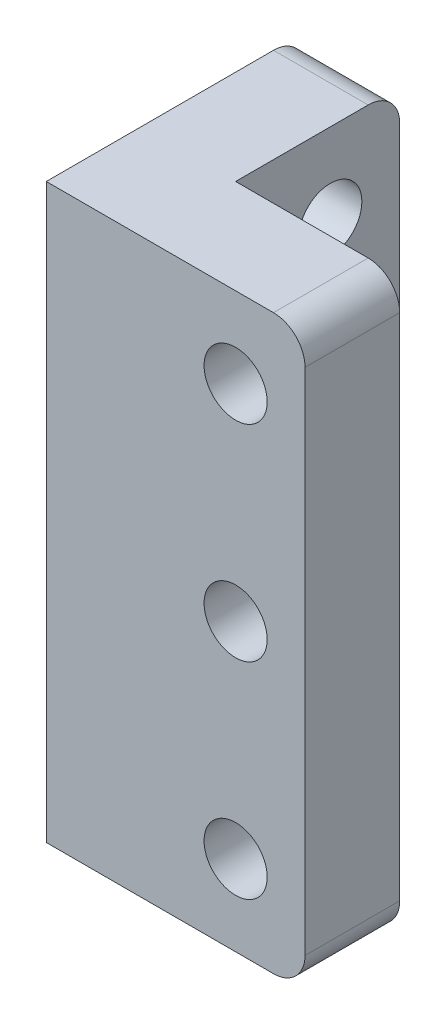
ISO-10303-21;
HEADER;
FILE_DESCRIPTION(('STEP AP214'),'2;1');
FILE_NAME('part.step','',(''),(''),'','','');
FILE_SCHEMA(('AUTOMOTIVE_DESIGN { 1 0 10303 214 1 1 1 1 }'));
ENDSEC;
DATA;
#1=APPLICATION_CONTEXT('core data for automotive mechanical design processes');
#2=APPLICATION_PROTOCOL_DEFINITION('international standard','automotive_design',2000,#1);
#3=PRODUCT_CONTEXT('',#1,'mechanical');
#4=PRODUCT('Part','Part','',(#3));
#5=PRODUCT_RELATED_PRODUCT_CATEGORY('part','',(#4));
#6=PRODUCT_DEFINITION_FORMATION('','',#4);
#7=PRODUCT_DEFINITION_CONTEXT('part definition',#1,'design');
#8=PRODUCT_DEFINITION('design','',#6,#7);
#9=PRODUCT_DEFINITION_SHAPE('','',#8);
#10=(LENGTH_UNIT() NAMED_UNIT(*) SI_UNIT(.MILLI.,.METRE.));
#11=(NAMED_UNIT(*) PLANE_ANGLE_UNIT() SI_UNIT($,.RADIAN.));
#12=(NAMED_UNIT(*) SI_UNIT($,.STERADIAN.) SOLID_ANGLE_UNIT());
#13=UNCERTAINTY_MEASURE_WITH_UNIT(LENGTH_MEASURE(1.E-05),#10,'distance_accuracy_value','');
#14=(GEOMETRIC_REPRESENTATION_CONTEXT(3) GLOBAL_UNCERTAINTY_ASSIGNED_CONTEXT((#13)) GLOBAL_UNIT_ASSIGNED_CONTEXT((#10,
#11,#12)) REPRESENTATION_CONTEXT('',''));
#15=CARTESIAN_POINT('',(0.,0.,0.));
#16=DIRECTION('',(0.,0.,1.));
#17=DIRECTION('',(1.,0.,0.));
#18=AXIS2_PLACEMENT_3D('',#15,#16,#17);
#19=CARTESIAN_POINT('',(3.,9.07,5.1));
#20=DIRECTION('',(0.,0.,-1.));
#21=DIRECTION('',(-1.,0.,0.));
#22=AXIS2_PLACEMENT_3D('',#19,#20,#21);
#23=CYLINDRICAL_SURFACE('',#22,1.);
#24=CARTESIAN_POINT('',(3.,9.07,3.));
#25=DIRECTION('',(0.,0.,-1.));
#26=DIRECTION('',(-1.,0.,0.));
#27=AXIS2_PLACEMENT_3D('',#24,#25,#26);
#28=CIRCLE('',#27,1.);
#29=CARTESIAN_POINT('',(2.,9.07,3.));
#30=VERTEX_POINT('',#29);
#31=EDGE_CURVE('E204',#30,#30,#28,.T.);
#32=ORIENTED_EDGE('',*,*,#31,.F.);
#33=EDGE_LOOP('',(#32));
#34=FACE_BOUND('',#33,.T.);
#35=CARTESIAN_POINT('',(3.,9.07,1.4));
#36=DIRECTION('',(0.,0.,-1.));
#37=DIRECTION('',(-1.,0.,0.));
#38=AXIS2_PLACEMENT_3D('',#35,#36,#37);
#39=CIRCLE('',#38,1.);
#40=CARTESIAN_POINT('',(2.,9.07,1.4));
#41=VERTEX_POINT('',#40);
#42=EDGE_CURVE('E37',#41,#41,#39,.F.);
#43=ORIENTED_EDGE('',*,*,#42,.F.);
#44=EDGE_LOOP('',(#43));
#45=FACE_BOUND('',#44,.T.);
#46=ADVANCED_FACE('F33',(#34,#45),#23,.F.);
#47=CARTESIAN_POINT('',(-5.1,9.07,-3.));
#48=DIRECTION('',(1.,0.,0.));
#49=DIRECTION('',(0.,0.,-1.));
#50=AXIS2_PLACEMENT_3D('',#47,#48,#49);
#51=CYLINDRICAL_SURFACE('',#50,1.);
#52=CARTESIAN_POINT('',(0.,9.07,-3.));
#53=DIRECTION('',(1.,0.,0.));
#54=DIRECTION('',(0.,0.,-1.));
#55=AXIS2_PLACEMENT_3D('',#52,#53,#54);
#56=CIRCLE('',#55,1.);
#57=CARTESIAN_POINT('',(0.,9.07,-4.));
#58=VERTEX_POINT('',#57);
#59=EDGE_CURVE('E202',#58,#58,#56,.T.);
#60=ORIENTED_EDGE('',*,*,#59,.T.);
#61=EDGE_LOOP('',(#60));
#62=FACE_BOUND('',#61,.T.);
#63=CARTESIAN_POINT('',(-1.6,9.07,-3.));
#64=DIRECTION('',(-1.,0.,0.));
#65=DIRECTION('',(0.,0.,1.));
#66=AXIS2_PLACEMENT_3D('',#63,#64,#65);
#67=CIRCLE('',#66,1.);
#68=CARTESIAN_POINT('',(-1.6,9.07,-2.));
#69=VERTEX_POINT('',#68);
#70=EDGE_CURVE('E200',#69,#69,#67,.F.);
#71=ORIENTED_EDGE('',*,*,#70,.F.);
#72=EDGE_LOOP('',(#71));
#73=FACE_BOUND('',#72,.T.);
#74=ADVANCED_FACE('F307',(#62,#73),#51,.F.);
#75=CARTESIAN_POINT('',(-3.,18.14,-5.2));
#76=DIRECTION('',(1.,0.,0.));
#77=DIRECTION('',(0.,0.,-1.));
#78=AXIS2_PLACEMENT_3D('',#75,#76,#77);
#79=PLANE('',#78);
#80=CARTESIAN_POINT('',(-3.,9.07,-3.));
#81=DIRECTION('',(-1.,0.,0.));
#82=DIRECTION('',(0.,0.,1.));
#83=AXIS2_PLACEMENT_3D('',#80,#81,#82);
#84=CIRCLE('',#83,1.7);
#85=CARTESIAN_POINT('',(-3.,9.07,-1.3));
#86=VERTEX_POINT('',#85);
#87=EDGE_CURVE('E206',#86,#86,#84,.T.);
#88=ORIENTED_EDGE('',*,*,#87,.F.);
#89=EDGE_LOOP('',(#88));
#90=FACE_BOUND('',#89,.T.);
#91=CARTESIAN_POINT('',(-3.,15.59,-3.));
#92=DIRECTION('',(-1.,0.,0.));
#93=DIRECTION('',(0.,0.,1.));
#94=AXIS2_PLACEMENT_3D('',#91,#92,#93);
#95=CIRCLE('',#94,1.7);
#96=CARTESIAN_POINT('',(-3.,15.59,-1.3));
#97=VERTEX_POINT('',#96);
#98=EDGE_CURVE('E238',#97,#97,#95,.T.);
#99=ORIENTED_EDGE('',*,*,#98,.F.);
#100=EDGE_LOOP('',(#99));
#101=FACE_BOUND('',#100,.T.);
#102=DIRECTION('',(0.,-1.,0.));
#103=VECTOR('',#102,1.);
#104=CARTESIAN_POINT('',(-3.,18.14,-5.2));
#105=LINE('',#104,#103);
#106=CARTESIAN_POINT('',(-3.,17.14,-5.2));
#107=VERTEX_POINT('',#106);
#108=CARTESIAN_POINT('',(-3.,1.,-5.2));
#109=VERTEX_POINT('',#108);
#110=EDGE_CURVE('E144',#107,#109,#105,.T.);
#111=ORIENTED_EDGE('',*,*,#110,.T.);
#112=CARTESIAN_POINT('',(-3.,1.,-4.2));
#113=DIRECTION('',(1.,0.,0.));
#114=DIRECTION('',(0.,0.,-1.));
#115=AXIS2_PLACEMENT_3D('',#112,#113,#114);
#116=CIRCLE('',#115,1.);
#117=CARTESIAN_POINT('',(-3.,0.,-4.2));
#118=VERTEX_POINT('',#117);
#119=EDGE_CURVE('E171',#109,#118,#116,.F.);
#120=ORIENTED_EDGE('',*,*,#119,.T.);
#121=DIRECTION('',(0.,0.,1.));
#122=VECTOR('',#121,1.);
#123=CARTESIAN_POINT('',(-3.,0.,-5.2));
#124=LINE('',#123,#122);
#125=CARTESIAN_POINT('',(-3.,0.,3.));
#126=VERTEX_POINT('',#125);
#127=EDGE_CURVE('E256',#118,#126,#124,.T.);
#128=ORIENTED_EDGE('',*,*,#127,.T.);
#129=DIRECTION('',(0.,-1.,0.));
#130=VECTOR('',#129,1.);
#131=CARTESIAN_POINT('',(-3.,18.14,3.));
#132=LINE('',#131,#130);
#133=CARTESIAN_POINT('',(-3.,18.14,3.));
#134=VERTEX_POINT('',#133);
#135=EDGE_CURVE('E264',#134,#126,#132,.T.);
#136=ORIENTED_EDGE('',*,*,#135,.F.);
#137=DIRECTION('',(0.,0.,1.));
#138=VECTOR('',#137,1.);
#139=CARTESIAN_POINT('',(-3.,18.14,-5.2));
#140=LINE('',#139,#138);
#141=CARTESIAN_POINT('',(-3.,18.14,-4.2));
#142=VERTEX_POINT('',#141);
#143=EDGE_CURVE('E131',#142,#134,#140,.T.);
#144=ORIENTED_EDGE('',*,*,#143,.F.);
#145=CARTESIAN_POINT('',(-3.,17.14,-4.2));
#146=DIRECTION('',(1.,0.,0.));
#147=DIRECTION('',(0.,0.,-1.));
#148=AXIS2_PLACEMENT_3D('',#145,#146,#147);
#149=CIRCLE('',#148,1.);
#150=EDGE_CURVE('E169',#142,#107,#149,.F.);
#151=ORIENTED_EDGE('',*,*,#150,.T.);
#152=EDGE_LOOP('',(#111,#120,#128,#136,#144,#151));
#153=FACE_BOUND('',#152,.T.);
#154=CARTESIAN_POINT('',(-3.,2.55,-3.));
#155=DIRECTION('',(1.,0.,0.));
#156=DIRECTION('',(0.,0.,1.));
#157=AXIS2_PLACEMENT_3D('',#154,#155,#156);
#158=CIRCLE('',#157,1.7);
#159=CARTESIAN_POINT('',(-3.,2.55,-1.3));
#160=VERTEX_POINT('',#159);
#161=EDGE_CURVE('E227',#160,#160,#158,.T.);
#162=ORIENTED_EDGE('',*,*,#161,.T.);
#163=EDGE_LOOP('',(#162));
#164=FACE_BOUND('',#163,.T.);
#165=ADVANCED_FACE('F268',(#90,#101,#153,#164),#79,.F.);
#166=CARTESIAN_POINT('',(-5.1,2.55,-3.));
#167=DIRECTION('',(1.,0.,0.));
#168=DIRECTION('',(0.,0.,-1.));
#169=AXIS2_PLACEMENT_3D('',#166,#167,#168);
#170=CYLINDRICAL_SURFACE('',#169,1.);
#171=CARTESIAN_POINT('',(0.,2.55,-3.));
#172=DIRECTION('',(-1.,0.,0.));
#173=DIRECTION('',(0.,0.,-1.));
#174=AXIS2_PLACEMENT_3D('',#171,#172,#173);
#175=CIRCLE('',#174,1.);
#176=CARTESIAN_POINT('',(0.,2.55,-4.));
#177=VERTEX_POINT('',#176);
#178=EDGE_CURVE('E190',#177,#177,#175,.T.);
#179=ORIENTED_EDGE('',*,*,#178,.F.);
#180=EDGE_LOOP('',(#179));
#181=FACE_BOUND('',#180,.T.);
#182=CARTESIAN_POINT('',(-1.6,2.55,-3.));
#183=DIRECTION('',(-1.,0.,0.));
#184=DIRECTION('',(0.,0.,1.));
#185=AXIS2_PLACEMENT_3D('',#182,#183,#184);
#186=CIRCLE('',#185,1.);
#187=CARTESIAN_POINT('',(-1.6,2.55,-2.));
#188=VERTEX_POINT('',#187);
#189=EDGE_CURVE('E195',#188,#188,#186,.T.);
#190=ORIENTED_EDGE('',*,*,#189,.T.);
#191=EDGE_LOOP('',(#190));
#192=FACE_BOUND('',#191,.T.);
#193=ADVANCED_FACE('F350',(#181,#192),#170,.F.);
#194=CARTESIAN_POINT('',(0.,18.14,0.));
#195=DIRECTION('',(0.,0.,1.));
#196=DIRECTION('',(1.,0.,0.));
#197=AXIS2_PLACEMENT_3D('',#194,#195,#196);
#198=PLANE('',#197);
#199=CARTESIAN_POINT('',(3.,9.07,0.));
#200=DIRECTION('',(0.,0.,-1.));
#201=DIRECTION('',(-1.,0.,0.));
#202=AXIS2_PLACEMENT_3D('',#199,#200,#201);
#203=CIRCLE('',#202,1.7);
#204=CARTESIAN_POINT('',(1.3,9.07,0.));
#205=VERTEX_POINT('',#204);
#206=EDGE_CURVE('E216',#205,#205,#203,.T.);
#207=ORIENTED_EDGE('',*,*,#206,.F.);
#208=EDGE_LOOP('',(#207));
#209=FACE_BOUND('',#208,.T.);
#210=CARTESIAN_POINT('',(3.,2.55,0.));
#211=DIRECTION('',(0.,0.,-1.));
#212=DIRECTION('',(-1.,0.,0.));
#213=AXIS2_PLACEMENT_3D('',#210,#211,#212);
#214=CIRCLE('',#213,1.7);
#215=CARTESIAN_POINT('',(1.3,2.55,0.));
#216=VERTEX_POINT('',#215);
#217=EDGE_CURVE('E185',#216,#216,#214,.T.);
#218=ORIENTED_EDGE('',*,*,#217,.F.);
#219=EDGE_LOOP('',(#218));
#220=FACE_BOUND('',#219,.T.);
#221=DIRECTION('',(0.,-1.,0.));
#222=VECTOR('',#221,1.);
#223=CARTESIAN_POINT('',(5.2,18.14,0.));
#224=LINE('',#223,#222);
#225=CARTESIAN_POINT('',(5.2,17.14,0.));
#226=VERTEX_POINT('',#225);
#227=CARTESIAN_POINT('',(5.2,1.,0.));
#228=VERTEX_POINT('',#227);
#229=EDGE_CURVE('E252',#226,#228,#224,.T.);
#230=ORIENTED_EDGE('',*,*,#229,.T.);
#231=CARTESIAN_POINT('',(4.2,1.,0.));
#232=DIRECTION('',(0.,0.,1.));
#233=DIRECTION('',(1.,0.,0.));
#234=AXIS2_PLACEMENT_3D('',#231,#232,#233);
#235=CIRCLE('',#234,1.);
#236=CARTESIAN_POINT('',(4.2,0.,0.));
#237=VERTEX_POINT('',#236);
#238=EDGE_CURVE('E152',#228,#237,#235,.F.);
#239=ORIENTED_EDGE('',*,*,#238,.T.);
#240=DIRECTION('',(-1.,0.,0.));
#241=VECTOR('',#240,1.);
#242=CARTESIAN_POINT('',(0.,0.,0.));
#243=LINE('',#242,#241);
#244=CARTESIAN_POINT('',(0.,0.,0.));
#245=VERTEX_POINT('',#244);
#246=EDGE_CURVE('E137',#237,#245,#243,.T.);
#247=ORIENTED_EDGE('',*,*,#246,.T.);
#248=DIRECTION('',(0.,-1.,0.));
#249=VECTOR('',#248,1.);
#250=CARTESIAN_POINT('',(0.,18.14,0.));
#251=LINE('',#250,#249);
#252=CARTESIAN_POINT('',(0.,18.14,0.));
#253=VERTEX_POINT('',#252);
#254=EDGE_CURVE('E129',#253,#245,#251,.T.);
#255=ORIENTED_EDGE('',*,*,#254,.F.);
#256=DIRECTION('',(-1.,0.,0.));
#257=VECTOR('',#256,1.);
#258=CARTESIAN_POINT('',(0.,18.14,0.));
#259=LINE('',#258,#257);
#260=CARTESIAN_POINT('',(4.2,18.14,0.));
#261=VERTEX_POINT('',#260);
#262=EDGE_CURVE('E113',#261,#253,#259,.T.);
#263=ORIENTED_EDGE('',*,*,#262,.F.);
#264=CARTESIAN_POINT('',(4.2,17.14,0.));
#265=DIRECTION('',(0.,0.,1.));
#266=DIRECTION('',(1.,0.,0.));
#267=AXIS2_PLACEMENT_3D('',#264,#265,#266);
#268=CIRCLE('',#267,1.);
#269=EDGE_CURVE('E150',#261,#226,#268,.F.);
#270=ORIENTED_EDGE('',*,*,#269,.T.);
#271=EDGE_LOOP('',(#230,#239,#247,#255,#263,#270));
#272=FACE_BOUND('',#271,.T.);
#273=CARTESIAN_POINT('',(3.,15.59,0.));
#274=DIRECTION('',(0.,0.,1.));
#275=DIRECTION('',(-1.,0.,0.));
#276=AXIS2_PLACEMENT_3D('',#273,#274,#275);
#277=CIRCLE('',#276,1.7);
#278=CARTESIAN_POINT('',(1.3,15.59,0.));
#279=VERTEX_POINT('',#278);
#280=EDGE_CURVE('E198',#279,#279,#277,.T.);
#281=ORIENTED_EDGE('',*,*,#280,.T.);
#282=EDGE_LOOP('',(#281));
#283=FACE_BOUND('',#282,.T.);
#284=ADVANCED_FACE('F134',(#209,#220,#272,#283),#198,.F.);
#285=CARTESIAN_POINT('',(3.,15.59,5.1));
#286=DIRECTION('',(0.,0.,-1.));
#287=DIRECTION('',(-1.,0.,0.));
#288=AXIS2_PLACEMENT_3D('',#285,#286,#287);
#289=CYLINDRICAL_SURFACE('',#288,1.);
#290=CARTESIAN_POINT('',(3.,15.59,3.));
#291=DIRECTION('',(0.,0.,-1.));
#292=DIRECTION('',(-1.,0.,0.));
#293=AXIS2_PLACEMENT_3D('',#290,#291,#292);
#294=CIRCLE('',#293,1.);
#295=CARTESIAN_POINT('',(2.,15.59,3.));
#296=VERTEX_POINT('',#295);
#297=EDGE_CURVE('E187',#296,#296,#294,.F.);
#298=ORIENTED_EDGE('',*,*,#297,.T.);
#299=EDGE_LOOP('',(#298));
#300=FACE_BOUND('',#299,.T.);
#301=CARTESIAN_POINT('',(3.,15.59,1.4));
#302=DIRECTION('',(0.,0.,-1.));
#303=DIRECTION('',(-1.,0.,0.));
#304=AXIS2_PLACEMENT_3D('',#301,#302,#303);
#305=CIRCLE('',#304,1.);
#306=CARTESIAN_POINT('',(2.,15.59,1.4));
#307=VERTEX_POINT('',#306);
#308=EDGE_CURVE('E191',#307,#307,#305,.T.);
#309=ORIENTED_EDGE('',*,*,#308,.T.);
#310=EDGE_LOOP('',(#309));
#311=FACE_BOUND('',#310,.T.);
#312=ADVANCED_FACE('F346',(#300,#311),#289,.F.);
#313=CARTESIAN_POINT('',(-3.,18.14,3.));
#314=DIRECTION('',(0.,0.,-1.));
#315=DIRECTION('',(-1.,0.,0.));
#316=AXIS2_PLACEMENT_3D('',#313,#314,#315);
#317=PLANE('',#316);
#318=ORIENTED_EDGE('',*,*,#31,.T.);
#319=EDGE_LOOP('',(#318));
#320=FACE_BOUND('',#319,.T.);
#321=DIRECTION('',(1.,0.,0.));
#322=VECTOR('',#321,1.);
#323=CARTESIAN_POINT('',(-3.,0.,3.));
#324=LINE('',#323,#322);
#325=CARTESIAN_POINT('',(4.2,0.,3.));
#326=VERTEX_POINT('',#325);
#327=EDGE_CURVE('E124',#126,#326,#324,.T.);
#328=ORIENTED_EDGE('',*,*,#327,.T.);
#329=CARTESIAN_POINT('',(4.2,1.,3.));
#330=DIRECTION('',(0.,0.,-1.));
#331=DIRECTION('',(-1.,0.,0.));
#332=AXIS2_PLACEMENT_3D('',#329,#330,#331);
#333=CIRCLE('',#332,1.);
#334=CARTESIAN_POINT('',(5.2,1.,3.));
#335=VERTEX_POINT('',#334);
#336=EDGE_CURVE('E160',#326,#335,#333,.F.);
#337=ORIENTED_EDGE('',*,*,#336,.T.);
#338=DIRECTION('',(0.,-1.,0.));
#339=VECTOR('',#338,1.);
#340=CARTESIAN_POINT('',(5.2,18.14,3.));
#341=LINE('',#340,#339);
#342=CARTESIAN_POINT('',(5.2,17.14,3.));
#343=VERTEX_POINT('',#342);
#344=EDGE_CURVE('E261',#343,#335,#341,.T.);
#345=ORIENTED_EDGE('',*,*,#344,.F.);
#346=CARTESIAN_POINT('',(4.2,17.14,3.));
#347=DIRECTION('',(0.,0.,-1.));
#348=DIRECTION('',(-1.,0.,0.));
#349=AXIS2_PLACEMENT_3D('',#346,#347,#348);
#350=CIRCLE('',#349,1.);
#351=CARTESIAN_POINT('',(4.2,18.14,3.));
#352=VERTEX_POINT('',#351);
#353=EDGE_CURVE('E158',#343,#352,#350,.F.);
#354=ORIENTED_EDGE('',*,*,#353,.T.);
#355=DIRECTION('',(1.,0.,0.));
#356=VECTOR('',#355,1.);
#357=CARTESIAN_POINT('',(-3.,18.14,3.));
#358=LINE('',#357,#356);
#359=EDGE_CURVE('E250',#134,#352,#358,.T.);
#360=ORIENTED_EDGE('',*,*,#359,.F.);
#361=ORIENTED_EDGE('',*,*,#135,.T.);
#362=EDGE_LOOP('',(#328,#337,#345,#354,#360,#361));
#363=FACE_BOUND('',#362,.T.);
#364=CARTESIAN_POINT('',(3.,2.55,3.));
#365=DIRECTION('',(0.,0.,-1.));
#366=DIRECTION('',(-1.,0.,0.));
#367=AXIS2_PLACEMENT_3D('',#364,#365,#366);
#368=CIRCLE('',#367,1.);
#369=CARTESIAN_POINT('',(2.,2.55,3.));
#370=VERTEX_POINT('',#369);
#371=EDGE_CURVE('E174',#370,#370,#368,.T.);
#372=ORIENTED_EDGE('',*,*,#371,.T.);
#373=EDGE_LOOP('',(#372));
#374=FACE_BOUND('',#373,.T.);
#375=ORIENTED_EDGE('',*,*,#297,.F.);
#376=EDGE_LOOP('',(#375));
#377=FACE_BOUND('',#376,.T.);
#378=ADVANCED_FACE('F279',(#320,#363,#374,#377),#317,.F.);
#379=CARTESIAN_POINT('',(0.,18.14,0.));
#380=DIRECTION('',(-1.,0.,0.));
#381=DIRECTION('',(0.,0.,1.));
#382=AXIS2_PLACEMENT_3D('',#379,#380,#381);
#383=PLANE('',#382);
#384=ORIENTED_EDGE('',*,*,#59,.F.);
#385=EDGE_LOOP('',(#384));
#386=FACE_BOUND('',#385,.T.);
#387=DIRECTION('',(0.,0.,-1.));
#388=VECTOR('',#387,1.);
#389=CARTESIAN_POINT('',(0.,0.,0.));
#390=LINE('',#389,#388);
#391=CARTESIAN_POINT('',(0.,0.,-4.2));
#392=VERTEX_POINT('',#391);
#393=EDGE_CURVE('E254',#245,#392,#390,.T.);
#394=ORIENTED_EDGE('',*,*,#393,.T.);
#395=CARTESIAN_POINT('',(0.,1.,-4.2));
#396=DIRECTION('',(-1.,0.,0.));
#397=DIRECTION('',(0.,0.,1.));
#398=AXIS2_PLACEMENT_3D('',#395,#396,#397);
#399=CIRCLE('',#398,1.);
#400=CARTESIAN_POINT('',(0.,1.,-5.2));
#401=VERTEX_POINT('',#400);
#402=EDGE_CURVE('E11',#392,#401,#399,.F.);
#403=ORIENTED_EDGE('',*,*,#402,.T.);
#404=DIRECTION('',(0.,-1.,0.));
#405=VECTOR('',#404,1.);
#406=CARTESIAN_POINT('',(0.,18.14,-5.2));
#407=LINE('',#406,#405);
#408=CARTESIAN_POINT('',(0.,17.14,-5.2));
#409=VERTEX_POINT('',#408);
#410=EDGE_CURVE('E140',#409,#401,#407,.T.);
#411=ORIENTED_EDGE('',*,*,#410,.F.);
#412=CARTESIAN_POINT('',(0.,17.14,-4.2));
#413=DIRECTION('',(-1.,0.,0.));
#414=DIRECTION('',(0.,0.,1.));
#415=AXIS2_PLACEMENT_3D('',#412,#413,#414);
#416=CIRCLE('',#415,1.);
#417=CARTESIAN_POINT('',(0.,18.14,-4.2));
#418=VERTEX_POINT('',#417);
#419=EDGE_CURVE('E42',#409,#418,#416,.F.);
#420=ORIENTED_EDGE('',*,*,#419,.T.);
#421=DIRECTION('',(0.,0.,-1.));
#422=VECTOR('',#421,1.);
#423=CARTESIAN_POINT('',(0.,18.14,0.));
#424=LINE('',#423,#422);
#425=EDGE_CURVE('E118',#253,#418,#424,.T.);
#426=ORIENTED_EDGE('',*,*,#425,.F.);
#427=ORIENTED_EDGE('',*,*,#254,.T.);
#428=EDGE_LOOP('',(#394,#403,#411,#420,#426,#427));
#429=FACE_BOUND('',#428,.T.);
#430=CARTESIAN_POINT('',(0.,15.59,-3.));
#431=DIRECTION('',(1.,0.,0.));
#432=DIRECTION('',(0.,0.,-1.));
#433=AXIS2_PLACEMENT_3D('',#430,#431,#432);
#434=CIRCLE('',#433,1.);
#435=CARTESIAN_POINT('',(0.,15.59,-4.));
#436=VERTEX_POINT('',#435);
#437=EDGE_CURVE('E177',#436,#436,#434,.T.);
#438=ORIENTED_EDGE('',*,*,#437,.F.);
#439=EDGE_LOOP('',(#438));
#440=FACE_BOUND('',#439,.T.);
#441=ORIENTED_EDGE('',*,*,#178,.T.);
#442=EDGE_LOOP('',(#441));
#443=FACE_BOUND('',#442,.T.);
#444=ADVANCED_FACE('F127',(#386,#429,#440,#443),#383,.F.);
#445=CARTESIAN_POINT('',(-5.1,15.59,-3.));
#446=DIRECTION('',(1.,0.,0.));
#447=DIRECTION('',(0.,0.,-1.));
#448=AXIS2_PLACEMENT_3D('',#445,#446,#447);
#449=CYLINDRICAL_SURFACE('',#448,1.);
#450=ORIENTED_EDGE('',*,*,#437,.T.);
#451=EDGE_LOOP('',(#450));
#452=FACE_BOUND('',#451,.T.);
#453=CARTESIAN_POINT('',(-1.6,15.59,-3.));
#454=DIRECTION('',(-1.,0.,0.));
#455=DIRECTION('',(0.,0.,1.));
#456=AXIS2_PLACEMENT_3D('',#453,#454,#455);
#457=CIRCLE('',#456,1.);
#458=CARTESIAN_POINT('',(-1.6,15.59,-2.));
#459=VERTEX_POINT('',#458);
#460=EDGE_CURVE('E182',#459,#459,#457,.F.);
#461=ORIENTED_EDGE('',*,*,#460,.F.);
#462=EDGE_LOOP('',(#461));
#463=FACE_BOUND('',#462,.T.);
#464=ADVANCED_FACE('F371',(#452,#463),#449,.F.);
#465=CARTESIAN_POINT('',(3.,2.55,5.1));
#466=DIRECTION('',(0.,0.,-1.));
#467=DIRECTION('',(-1.,0.,0.));
#468=AXIS2_PLACEMENT_3D('',#465,#466,#467);
#469=CYLINDRICAL_SURFACE('',#468,1.);
#470=ORIENTED_EDGE('',*,*,#371,.F.);
#471=EDGE_LOOP('',(#470));
#472=FACE_BOUND('',#471,.T.);
#473=CARTESIAN_POINT('',(3.,2.55,1.4));
#474=DIRECTION('',(0.,0.,-1.));
#475=DIRECTION('',(-1.,0.,0.));
#476=AXIS2_PLACEMENT_3D('',#473,#474,#475);
#477=CIRCLE('',#476,1.);
#478=CARTESIAN_POINT('',(2.,2.55,1.4));
#479=VERTEX_POINT('',#478);
#480=EDGE_CURVE('E178',#479,#479,#477,.F.);
#481=ORIENTED_EDGE('',*,*,#480,.F.);
#482=EDGE_LOOP('',(#481));
#483=FACE_BOUND('',#482,.T.);
#484=ADVANCED_FACE('F368',(#472,#483),#469,.F.);
#485=CARTESIAN_POINT('',(0.,18.14,-5.2));
#486=DIRECTION('',(0.,0.,1.));
#487=DIRECTION('',(1.,0.,0.));
#488=AXIS2_PLACEMENT_3D('',#485,#486,#487);
#489=PLANE('',#488);
#490=ORIENTED_EDGE('',*,*,#410,.T.);
#491=DIRECTION('',(-1.,0.,0.));
#492=VECTOR('',#491,1.);
#493=CARTESIAN_POINT('',(0.,1.,-5.2));
#494=LINE('',#493,#492);
#495=EDGE_CURVE('E166',#401,#109,#494,.T.);
#496=ORIENTED_EDGE('',*,*,#495,.T.);
#497=ORIENTED_EDGE('',*,*,#110,.F.);
#498=DIRECTION('',(-1.,0.,0.));
#499=VECTOR('',#498,1.);
#500=CARTESIAN_POINT('',(0.,17.14,-5.2));
#501=LINE('',#500,#499);
#502=EDGE_CURVE('E55',#107,#409,#501,.F.);
#503=ORIENTED_EDGE('',*,*,#502,.T.);
#504=EDGE_LOOP('',(#490,#496,#497,#503));
#505=FACE_BOUND('',#504,.T.);
#506=ADVANCED_FACE('F272',(#505),#489,.F.);
#507=CARTESIAN_POINT('',(5.2,18.14,3.));
#508=DIRECTION('',(-1.,0.,0.));
#509=DIRECTION('',(0.,0.,1.));
#510=AXIS2_PLACEMENT_3D('',#507,#508,#509);
#511=PLANE('',#510);
#512=ORIENTED_EDGE('',*,*,#344,.T.);
#513=DIRECTION('',(0.,0.,-1.));
#514=VECTOR('',#513,1.);
#515=CARTESIAN_POINT('',(5.2,1.,3.));
#516=LINE('',#515,#514);
#517=EDGE_CURVE('E142',#335,#228,#516,.T.);
#518=ORIENTED_EDGE('',*,*,#517,.T.);
#519=ORIENTED_EDGE('',*,*,#229,.F.);
#520=DIRECTION('',(0.,0.,-1.));
#521=VECTOR('',#520,1.);
#522=CARTESIAN_POINT('',(5.2,17.14,3.));
#523=LINE('',#522,#521);
#524=EDGE_CURVE('E139',#226,#343,#523,.F.);
#525=ORIENTED_EDGE('',*,*,#524,.T.);
#526=EDGE_LOOP('',(#512,#518,#519,#525));
#527=FACE_BOUND('',#526,.T.);
#528=ADVANCED_FACE('F288',(#527),#511,.F.);
#529=CARTESIAN_POINT('',(0.,18.14,0.));
#530=DIRECTION('',(0.,1.,0.));
#531=DIRECTION('',(0.,0.,1.));
#532=AXIS2_PLACEMENT_3D('',#529,#530,#531);
#533=PLANE('',#532);
#534=ORIENTED_EDGE('',*,*,#359,.T.);
#535=DIRECTION('',(0.,0.,-1.));
#536=VECTOR('',#535,1.);
#537=CARTESIAN_POINT('',(4.2,18.14,0.));
#538=LINE('',#537,#536);
#539=EDGE_CURVE('E121',#352,#261,#538,.T.);
#540=ORIENTED_EDGE('',*,*,#539,.T.);
#541=ORIENTED_EDGE('',*,*,#262,.T.);
#542=ORIENTED_EDGE('',*,*,#425,.T.);
#543=DIRECTION('',(-1.,0.,0.));
#544=VECTOR('',#543,1.);
#545=CARTESIAN_POINT('',(-3.,18.14,-4.2));
#546=LINE('',#545,#544);
#547=EDGE_CURVE('E162',#418,#142,#546,.T.);
#548=ORIENTED_EDGE('',*,*,#547,.T.);
#549=ORIENTED_EDGE('',*,*,#143,.T.);
#550=EDGE_LOOP('',(#534,#540,#541,#542,#548,#549));
#551=FACE_BOUND('',#550,.T.);
#552=ADVANCED_FACE('F116',(#551),#533,.T.);
#553=CARTESIAN_POINT('',(0.,0.,0.));
#554=DIRECTION('',(0.,1.,0.));
#555=DIRECTION('',(0.,0.,1.));
#556=AXIS2_PLACEMENT_3D('',#553,#554,#555);
#557=PLANE('',#556);
#558=ORIENTED_EDGE('',*,*,#246,.F.);
#559=DIRECTION('',(0.,0.,-1.));
#560=VECTOR('',#559,1.);
#561=CARTESIAN_POINT('',(4.2,0.,0.));
#562=LINE('',#561,#560);
#563=EDGE_CURVE('E156',#237,#326,#562,.F.);
#564=ORIENTED_EDGE('',*,*,#563,.T.);
#565=ORIENTED_EDGE('',*,*,#327,.F.);
#566=ORIENTED_EDGE('',*,*,#127,.F.);
#567=DIRECTION('',(-1.,0.,0.));
#568=VECTOR('',#567,1.);
#569=CARTESIAN_POINT('',(0.,0.,-4.2));
#570=LINE('',#569,#568);
#571=EDGE_CURVE('E154',#118,#392,#570,.F.);
#572=ORIENTED_EDGE('',*,*,#571,.T.);
#573=ORIENTED_EDGE('',*,*,#393,.F.);
#574=EDGE_LOOP('',(#558,#564,#565,#566,#572,#573));
#575=FACE_BOUND('',#574,.T.);
#576=ADVANCED_FACE('F295',(#575),#557,.F.);
#577=CARTESIAN_POINT('',(4.2,1.,3.));
#578=DIRECTION('',(0.,0.,-1.));
#579=DIRECTION('',(-1.,0.,0.));
#580=AXIS2_PLACEMENT_3D('',#577,#578,#579);
#581=CYLINDRICAL_SURFACE('',#580,1.);
#582=ORIENTED_EDGE('',*,*,#336,.F.);
#583=ORIENTED_EDGE('',*,*,#563,.F.);
#584=ORIENTED_EDGE('',*,*,#238,.F.);
#585=ORIENTED_EDGE('',*,*,#517,.F.);
#586=EDGE_LOOP('',(#582,#583,#584,#585));
#587=FACE_BOUND('',#586,.T.);
#588=ADVANCED_FACE('F292',(#587),#581,.T.);
#589=CARTESIAN_POINT('',(4.2,17.14,0.));
#590=DIRECTION('',(0.,0.,1.));
#591=DIRECTION('',(1.,0.,0.));
#592=AXIS2_PLACEMENT_3D('',#589,#590,#591);
#593=CYLINDRICAL_SURFACE('',#592,1.);
#594=ORIENTED_EDGE('',*,*,#353,.F.);
#595=ORIENTED_EDGE('',*,*,#524,.F.);
#596=ORIENTED_EDGE('',*,*,#269,.F.);
#597=ORIENTED_EDGE('',*,*,#539,.F.);
#598=EDGE_LOOP('',(#594,#595,#596,#597));
#599=FACE_BOUND('',#598,.T.);
#600=ADVANCED_FACE('F284',(#599),#593,.T.);
#601=CARTESIAN_POINT('',(0.,1.,-4.2));
#602=DIRECTION('',(-1.,0.,0.));
#603=DIRECTION('',(0.,0.,1.));
#604=AXIS2_PLACEMENT_3D('',#601,#602,#603);
#605=CYLINDRICAL_SURFACE('',#604,1.);
#606=ORIENTED_EDGE('',*,*,#402,.F.);
#607=ORIENTED_EDGE('',*,*,#571,.F.);
#608=ORIENTED_EDGE('',*,*,#119,.F.);
#609=ORIENTED_EDGE('',*,*,#495,.F.);
#610=EDGE_LOOP('',(#606,#607,#608,#609));
#611=FACE_BOUND('',#610,.T.);
#612=ADVANCED_FACE('F298',(#611),#605,.T.);
#613=CARTESIAN_POINT('',(0.,17.14,-4.2));
#614=DIRECTION('',(1.,0.,0.));
#615=DIRECTION('',(0.,0.,-1.));
#616=AXIS2_PLACEMENT_3D('',#613,#614,#615);
#617=CYLINDRICAL_SURFACE('',#616,1.);
#618=ORIENTED_EDGE('',*,*,#419,.F.);
#619=ORIENTED_EDGE('',*,*,#502,.F.);
#620=ORIENTED_EDGE('',*,*,#150,.F.);
#621=ORIENTED_EDGE('',*,*,#547,.F.);
#622=EDGE_LOOP('',(#618,#619,#620,#621));
#623=FACE_BOUND('',#622,.T.);
#624=ADVANCED_FACE('F35',(#623),#617,.T.);
#625=CARTESIAN_POINT('',(3.,2.55,1.4));
#626=DIRECTION('',(0.,0.,-1.));
#627=DIRECTION('',(-1.,0.,0.));
#628=AXIS2_PLACEMENT_3D('',#625,#626,#627);
#629=PLANE('',#628);
#630=CARTESIAN_POINT('',(3.,2.55,1.4));
#631=DIRECTION('',(0.,0.,-1.));
#632=DIRECTION('',(-1.,0.,0.));
#633=AXIS2_PLACEMENT_3D('',#630,#631,#632);
#634=CIRCLE('',#633,1.7);
#635=CARTESIAN_POINT('',(1.3,2.55,1.4));
#636=VERTEX_POINT('',#635);
#637=EDGE_CURVE('E181',#636,#636,#634,.T.);
#638=ORIENTED_EDGE('',*,*,#637,.T.);
#639=EDGE_LOOP('',(#638));
#640=FACE_BOUND('',#639,.T.);
#641=ORIENTED_EDGE('',*,*,#480,.T.);
#642=EDGE_LOOP('',(#641));
#643=FACE_BOUND('',#642,.T.);
#644=ADVANCED_FACE('F304',(#640,#643),#629,.T.);
#645=CARTESIAN_POINT('',(3.,2.55,1.4));
#646=DIRECTION('',(0.,0.,-1.));
#647=DIRECTION('',(-1.,0.,0.));
#648=AXIS2_PLACEMENT_3D('',#645,#646,#647);
#649=CYLINDRICAL_SURFACE('',#648,1.7);
#650=ORIENTED_EDGE('',*,*,#637,.F.);
#651=EDGE_LOOP('',(#650));
#652=FACE_BOUND('',#651,.T.);
#653=ORIENTED_EDGE('',*,*,#217,.T.);
#654=EDGE_LOOP('',(#653));
#655=FACE_BOUND('',#654,.T.);
#656=ADVANCED_FACE('F357',(#652,#655),#649,.F.);
#657=CARTESIAN_POINT('',(-1.6,15.59,-3.));
#658=DIRECTION('',(-1.,0.,0.));
#659=DIRECTION('',(0.,0.,1.));
#660=AXIS2_PLACEMENT_3D('',#657,#658,#659);
#661=PLANE('',#660);
#662=CARTESIAN_POINT('',(-1.6,15.59,-3.));
#663=DIRECTION('',(-1.,0.,0.));
#664=DIRECTION('',(0.,0.,1.));
#665=AXIS2_PLACEMENT_3D('',#662,#663,#664);
#666=CIRCLE('',#665,1.7);
#667=CARTESIAN_POINT('',(-1.6,15.59,-1.3));
#668=VERTEX_POINT('',#667);
#669=EDGE_CURVE('E186',#668,#668,#666,.T.);
#670=ORIENTED_EDGE('',*,*,#669,.T.);
#671=EDGE_LOOP('',(#670));
#672=FACE_BOUND('',#671,.T.);
#673=ORIENTED_EDGE('',*,*,#460,.T.);
#674=EDGE_LOOP('',(#673));
#675=FACE_BOUND('',#674,.T.);
#676=ADVANCED_FACE('F354',(#672,#675),#661,.T.);
#677=CARTESIAN_POINT('',(-1.6,15.59,-3.));
#678=DIRECTION('',(-1.,0.,0.));
#679=DIRECTION('',(0.,0.,1.));
#680=AXIS2_PLACEMENT_3D('',#677,#678,#679);
#681=CYLINDRICAL_SURFACE('',#680,1.7);
#682=ORIENTED_EDGE('',*,*,#669,.F.);
#683=EDGE_LOOP('',(#682));
#684=FACE_BOUND('',#683,.T.);
#685=ORIENTED_EDGE('',*,*,#98,.T.);
#686=EDGE_LOOP('',(#685));
#687=FACE_BOUND('',#686,.T.);
#688=ADVANCED_FACE('F344',(#684,#687),#681,.F.);
#689=CARTESIAN_POINT('',(3.,15.59,1.4));
#690=DIRECTION('',(0.,0.,-1.));
#691=DIRECTION('',(-1.,0.,0.));
#692=AXIS2_PLACEMENT_3D('',#689,#690,#691);
#693=CYLINDRICAL_SURFACE('',#692,1.7);
#694=CARTESIAN_POINT('',(3.,15.59,1.4));
#695=DIRECTION('',(0.,0.,1.));
#696=DIRECTION('',(-1.,0.,0.));
#697=AXIS2_PLACEMENT_3D('',#694,#695,#696);
#698=CIRCLE('',#697,1.7);
#699=CARTESIAN_POINT('',(1.3,15.59,1.4));
#700=VERTEX_POINT('',#699);
#701=EDGE_CURVE('E194',#700,#700,#698,.T.);
#702=ORIENTED_EDGE('',*,*,#701,.T.);
#703=EDGE_LOOP('',(#702));
#704=FACE_BOUND('',#703,.T.);
#705=ORIENTED_EDGE('',*,*,#280,.F.);
#706=EDGE_LOOP('',(#705));
#707=FACE_BOUND('',#706,.T.);
#708=ADVANCED_FACE('F340',(#704,#707),#693,.F.);
#709=CARTESIAN_POINT('',(3.,15.59,1.4));
#710=DIRECTION('',(0.,0.,-1.));
#711=DIRECTION('',(-1.,0.,0.));
#712=AXIS2_PLACEMENT_3D('',#709,#710,#711);
#713=PLANE('',#712);
#714=ORIENTED_EDGE('',*,*,#308,.F.);
#715=EDGE_LOOP('',(#714));
#716=FACE_BOUND('',#715,.T.);
#717=ORIENTED_EDGE('',*,*,#701,.F.);
#718=EDGE_LOOP('',(#717));
#719=FACE_BOUND('',#718,.T.);
#720=ADVANCED_FACE('F336',(#716,#719),#713,.T.);
#721=CARTESIAN_POINT('',(-1.6,2.55,-3.));
#722=DIRECTION('',(-1.,0.,0.));
#723=DIRECTION('',(0.,0.,1.));
#724=AXIS2_PLACEMENT_3D('',#721,#722,#723);
#725=CYLINDRICAL_SURFACE('',#724,1.7);
#726=CARTESIAN_POINT('',(-1.6,2.55,-3.));
#727=DIRECTION('',(1.,0.,0.));
#728=DIRECTION('',(0.,0.,1.));
#729=AXIS2_PLACEMENT_3D('',#726,#727,#728);
#730=CIRCLE('',#729,1.7);
#731=CARTESIAN_POINT('',(-1.6,2.55,-1.3));
#732=VERTEX_POINT('',#731);
#733=EDGE_CURVE('E199',#732,#732,#730,.T.);
#734=ORIENTED_EDGE('',*,*,#733,.T.);
#735=EDGE_LOOP('',(#734));
#736=FACE_BOUND('',#735,.T.);
#737=ORIENTED_EDGE('',*,*,#161,.F.);
#738=EDGE_LOOP('',(#737));
#739=FACE_BOUND('',#738,.T.);
#740=ADVANCED_FACE('F332',(#736,#739),#725,.F.);
#741=CARTESIAN_POINT('',(-1.6,2.55,-3.));
#742=DIRECTION('',(-1.,0.,0.));
#743=DIRECTION('',(0.,0.,1.));
#744=AXIS2_PLACEMENT_3D('',#741,#742,#743);
#745=PLANE('',#744);
#746=ORIENTED_EDGE('',*,*,#189,.F.);
#747=EDGE_LOOP('',(#746));
#748=FACE_BOUND('',#747,.T.);
#749=ORIENTED_EDGE('',*,*,#733,.F.);
#750=EDGE_LOOP('',(#749));
#751=FACE_BOUND('',#750,.T.);
#752=ADVANCED_FACE('F324',(#748,#751),#745,.T.);
#753=CARTESIAN_POINT('',(-1.6,9.07,-3.));
#754=DIRECTION('',(-1.,0.,0.));
#755=DIRECTION('',(0.,0.,1.));
#756=AXIS2_PLACEMENT_3D('',#753,#754,#755);
#757=PLANE('',#756);
#758=CARTESIAN_POINT('',(-1.6,9.07,-3.));
#759=DIRECTION('',(-1.,0.,0.));
#760=DIRECTION('',(0.,0.,1.));
#761=AXIS2_PLACEMENT_3D('',#758,#759,#760);
#762=CIRCLE('',#761,1.7);
#763=CARTESIAN_POINT('',(-1.6,9.07,-1.3));
#764=VERTEX_POINT('',#763);
#765=EDGE_CURVE('E203',#764,#764,#762,.T.);
#766=ORIENTED_EDGE('',*,*,#765,.T.);
#767=EDGE_LOOP('',(#766));
#768=FACE_BOUND('',#767,.T.);
#769=ORIENTED_EDGE('',*,*,#70,.T.);
#770=EDGE_LOOP('',(#769));
#771=FACE_BOUND('',#770,.T.);
#772=ADVANCED_FACE('F320',(#768,#771),#757,.T.);
#773=CARTESIAN_POINT('',(-1.6,9.07,-3.));
#774=DIRECTION('',(-1.,0.,0.));
#775=DIRECTION('',(0.,0.,1.));
#776=AXIS2_PLACEMENT_3D('',#773,#774,#775);
#777=CYLINDRICAL_SURFACE('',#776,1.7);
#778=ORIENTED_EDGE('',*,*,#765,.F.);
#779=EDGE_LOOP('',(#778));
#780=FACE_BOUND('',#779,.T.);
#781=ORIENTED_EDGE('',*,*,#87,.T.);
#782=EDGE_LOOP('',(#781));
#783=FACE_BOUND('',#782,.T.);
#784=ADVANCED_FACE('F323',(#780,#783),#777,.F.);
#785=CARTESIAN_POINT('',(3.,9.07,1.4));
#786=DIRECTION('',(0.,0.,-1.));
#787=DIRECTION('',(-1.,0.,0.));
#788=AXIS2_PLACEMENT_3D('',#785,#786,#787);
#789=PLANE('',#788);
#790=CARTESIAN_POINT('',(3.,9.07,1.4));
#791=DIRECTION('',(0.,0.,-1.));
#792=DIRECTION('',(-1.,0.,0.));
#793=AXIS2_PLACEMENT_3D('',#790,#791,#792);
#794=CIRCLE('',#793,1.7);
#795=CARTESIAN_POINT('',(1.3,9.07,1.4));
#796=VERTEX_POINT('',#795);
#797=EDGE_CURVE('E212',#796,#796,#794,.T.);
#798=ORIENTED_EDGE('',*,*,#797,.T.);
#799=EDGE_LOOP('',(#798));
#800=FACE_BOUND('',#799,.T.);
#801=ORIENTED_EDGE('',*,*,#42,.T.);
#802=EDGE_LOOP('',(#801));
#803=FACE_BOUND('',#802,.T.);
#804=ADVANCED_FACE('F327',(#800,#803),#789,.T.);
#805=CARTESIAN_POINT('',(3.,9.07,1.4));
#806=DIRECTION('',(0.,0.,-1.));
#807=DIRECTION('',(-1.,0.,0.));
#808=AXIS2_PLACEMENT_3D('',#805,#806,#807);
#809=CYLINDRICAL_SURFACE('',#808,1.7);
#810=ORIENTED_EDGE('',*,*,#797,.F.);
#811=EDGE_LOOP('',(#810));
#812=FACE_BOUND('',#811,.T.);
#813=ORIENTED_EDGE('',*,*,#206,.T.);
#814=EDGE_LOOP('',(#813));
#815=FACE_BOUND('',#814,.T.);
#816=ADVANCED_FACE('F318',(#812,#815),#809,.F.);
#817=CLOSED_SHELL('',(#46,#74,#165,#193,#284,#312,#378,#444,#464,#484,#506,#528,#552,#576,#588,
#600,#612,#624,#644,#656,#676,#688,#708,#720,#740,#752,#772,#784,#804,#816));
#818=MANIFOLD_SOLID_BREP('B2',#817);
#819=ADVANCED_BREP_SHAPE_REPRESENTATION('',(#18,#818),#14);
#820=SHAPE_DEFINITION_REPRESENTATION(#9,#819);
ENDSEC;
END-ISO-10303-21;
